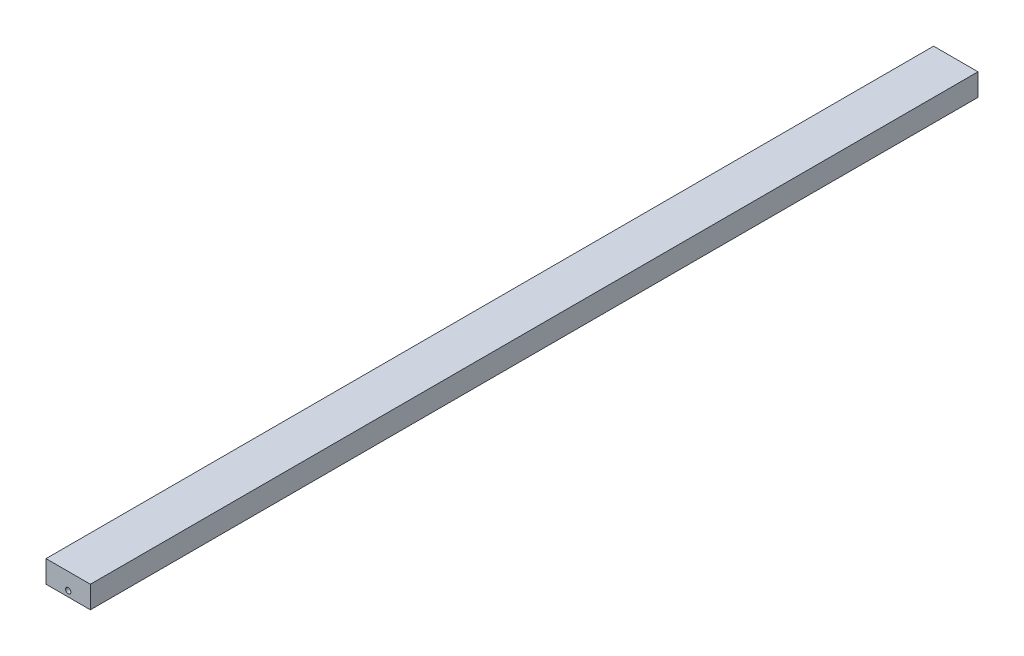
ISO-10303-21;
HEADER;
FILE_DESCRIPTION(('STEP AP214'),'2;1');
FILE_NAME('part.step','',(''),(''),'','','');
FILE_SCHEMA(('AUTOMOTIVE_DESIGN { 1 0 10303 214 1 1 1 1 }'));
ENDSEC;
DATA;
#1=APPLICATION_CONTEXT('core data for automotive mechanical design processes');
#2=APPLICATION_PROTOCOL_DEFINITION('international standard','automotive_design',2000,#1);
#3=PRODUCT_CONTEXT('',#1,'mechanical');
#4=PRODUCT('Part','Part','',(#3));
#5=PRODUCT_RELATED_PRODUCT_CATEGORY('part','',(#4));
#6=PRODUCT_DEFINITION_FORMATION('','',#4);
#7=PRODUCT_DEFINITION_CONTEXT('part definition',#1,'design');
#8=PRODUCT_DEFINITION('design','',#6,#7);
#9=PRODUCT_DEFINITION_SHAPE('','',#8);
#10=(LENGTH_UNIT() NAMED_UNIT(*) SI_UNIT(.MILLI.,.METRE.));
#11=(NAMED_UNIT(*) PLANE_ANGLE_UNIT() SI_UNIT($,.RADIAN.));
#12=(NAMED_UNIT(*) SI_UNIT($,.STERADIAN.) SOLID_ANGLE_UNIT());
#13=UNCERTAINTY_MEASURE_WITH_UNIT(LENGTH_MEASURE(1.E-05),#10,'distance_accuracy_value','');
#14=(GEOMETRIC_REPRESENTATION_CONTEXT(3) GLOBAL_UNCERTAINTY_ASSIGNED_CONTEXT((#13)) GLOBAL_UNIT_ASSIGNED_CONTEXT((#10,
#11,#12)) REPRESENTATION_CONTEXT('',''));
#15=CARTESIAN_POINT('',(0.,0.,0.));
#16=DIRECTION('',(0.,0.,1.));
#17=DIRECTION('',(1.,0.,0.));
#18=AXIS2_PLACEMENT_3D('',#15,#16,#17);
#19=CARTESIAN_POINT('',(0.,-1.25,200.));
#20=DIRECTION('',(0.,0.,-1.));
#21=DIRECTION('',(-1.,0.,0.));
#22=AXIS2_PLACEMENT_3D('',#19,#20,#21);
#23=CYLINDRICAL_SURFACE('',#22,0.6);
#24=CARTESIAN_POINT('',(0.,-1.25,200.));
#25=DIRECTION('',(0.,0.,1.));
#26=DIRECTION('',(1.,0.,0.));
#27=AXIS2_PLACEMENT_3D('',#24,#25,#26);
#28=CIRCLE('',#27,0.6);
#29=CARTESIAN_POINT('',(0.6,-1.25,200.));
#30=VERTEX_POINT('',#29);
#31=CARTESIAN_POINT('',(-0.6,-1.25,200.));
#32=VERTEX_POINT('',#31);
#33=EDGE_CURVE('E138',#30,#32,#28,.T.);
#34=ORIENTED_EDGE('',*,*,#33,.T.);
#35=DIRECTION('',(0.,0.,-1.));
#36=VECTOR('',#35,1.);
#37=CARTESIAN_POINT('',(-0.6,-1.25,200.));
#38=LINE('',#37,#36);
#39=CARTESIAN_POINT('',(-0.6,-1.25,0.));
#40=VERTEX_POINT('',#39);
#41=EDGE_CURVE('E12',#32,#40,#38,.T.);
#42=ORIENTED_EDGE('',*,*,#41,.T.);
#43=CARTESIAN_POINT('',(0.,-1.25,0.));
#44=DIRECTION('',(0.,0.,1.));
#45=DIRECTION('',(1.,0.,0.));
#46=AXIS2_PLACEMENT_3D('',#43,#44,#45);
#47=CIRCLE('',#46,0.6);
#48=CARTESIAN_POINT('',(0.6,-1.25,0.));
#49=VERTEX_POINT('',#48);
#50=EDGE_CURVE('E140',#49,#40,#47,.T.);
#51=ORIENTED_EDGE('',*,*,#50,.F.);
#52=DIRECTION('',(0.,0.,-1.));
#53=VECTOR('',#52,1.);
#54=CARTESIAN_POINT('',(0.6,-1.25,200.));
#55=LINE('',#54,#53);
#56=EDGE_CURVE('E56',#49,#30,#55,.F.);
#57=ORIENTED_EDGE('',*,*,#56,.T.);
#58=EDGE_LOOP('',(#34,#42,#51,#57));
#59=FACE_BOUND('',#58,.T.);
#60=ADVANCED_FACE('F47',(#59),#23,.F.);
#61=CARTESIAN_POINT('',(5.,2.5,200.));
#62=DIRECTION('',(-1.,0.,0.));
#63=DIRECTION('',(0.,0.,1.));
#64=AXIS2_PLACEMENT_3D('',#61,#62,#63);
#65=PLANE('',#64);
#66=DIRECTION('',(0.,1.,0.));
#67=VECTOR('',#66,1.);
#68=CARTESIAN_POINT('',(5.,2.5,0.));
#69=LINE('',#68,#67);
#70=CARTESIAN_POINT('',(5.,-2.5,0.));
#71=VERTEX_POINT('',#70);
#72=CARTESIAN_POINT('',(5.,2.5,0.));
#73=VERTEX_POINT('',#72);
#74=EDGE_CURVE('E122',#71,#73,#69,.T.);
#75=ORIENTED_EDGE('',*,*,#74,.T.);
#76=DIRECTION('',(0.,0.,-1.));
#77=VECTOR('',#76,1.);
#78=CARTESIAN_POINT('',(5.,2.5,200.));
#79=LINE('',#78,#77);
#80=CARTESIAN_POINT('',(5.,2.5,200.));
#81=VERTEX_POINT('',#80);
#82=EDGE_CURVE('E103',#81,#73,#79,.T.);
#83=ORIENTED_EDGE('',*,*,#82,.F.);
#84=DIRECTION('',(0.,1.,0.));
#85=VECTOR('',#84,1.);
#86=CARTESIAN_POINT('',(5.,2.5,200.));
#87=LINE('',#86,#85);
#88=CARTESIAN_POINT('',(5.,-2.5,200.));
#89=VERTEX_POINT('',#88);
#90=EDGE_CURVE('E110',#89,#81,#87,.T.);
#91=ORIENTED_EDGE('',*,*,#90,.F.);
#92=DIRECTION('',(0.,0.,-1.));
#93=VECTOR('',#92,1.);
#94=CARTESIAN_POINT('',(5.,-2.5,200.));
#95=LINE('',#94,#93);
#96=EDGE_CURVE('E130',#89,#71,#95,.T.);
#97=ORIENTED_EDGE('',*,*,#96,.T.);
#98=EDGE_LOOP('',(#75,#83,#91,#97));
#99=FACE_BOUND('',#98,.T.);
#100=ADVANCED_FACE('F49',(#99),#65,.F.);
#101=CARTESIAN_POINT('',(-5.,2.5,200.));
#102=DIRECTION('',(0.,-1.,0.));
#103=DIRECTION('',(0.,0.,-1.));
#104=AXIS2_PLACEMENT_3D('',#101,#102,#103);
#105=PLANE('',#104);
#106=DIRECTION('',(-1.,0.,0.));
#107=VECTOR('',#106,1.);
#108=CARTESIAN_POINT('',(-5.,2.5,0.));
#109=LINE('',#108,#107);
#110=CARTESIAN_POINT('',(-5.,2.5,0.));
#111=VERTEX_POINT('',#110);
#112=EDGE_CURVE('E135',#73,#111,#109,.T.);
#113=ORIENTED_EDGE('',*,*,#112,.T.);
#114=DIRECTION('',(0.,0.,-1.));
#115=VECTOR('',#114,1.);
#116=CARTESIAN_POINT('',(-5.,2.5,200.));
#117=LINE('',#116,#115);
#118=CARTESIAN_POINT('',(-5.,2.5,200.));
#119=VERTEX_POINT('',#118);
#120=EDGE_CURVE('E106',#119,#111,#117,.T.);
#121=ORIENTED_EDGE('',*,*,#120,.F.);
#122=DIRECTION('',(-1.,0.,0.));
#123=VECTOR('',#122,1.);
#124=CARTESIAN_POINT('',(-5.,2.5,200.));
#125=LINE('',#124,#123);
#126=EDGE_CURVE('E99',#81,#119,#125,.T.);
#127=ORIENTED_EDGE('',*,*,#126,.F.);
#128=ORIENTED_EDGE('',*,*,#82,.T.);
#129=EDGE_LOOP('',(#113,#121,#127,#128));
#130=FACE_BOUND('',#129,.T.);
#131=ADVANCED_FACE('F101',(#130),#105,.F.);
#132=CARTESIAN_POINT('',(-5.,2.5,200.));
#133=DIRECTION('',(1.,0.,0.));
#134=DIRECTION('',(0.,0.,-1.));
#135=AXIS2_PLACEMENT_3D('',#132,#133,#134);
#136=PLANE('',#135);
#137=DIRECTION('',(0.,-1.,0.));
#138=VECTOR('',#137,1.);
#139=CARTESIAN_POINT('',(-5.,2.5,0.));
#140=LINE('',#139,#138);
#141=CARTESIAN_POINT('',(-5.,-2.5,0.));
#142=VERTEX_POINT('',#141);
#143=EDGE_CURVE('E133',#111,#142,#140,.T.);
#144=ORIENTED_EDGE('',*,*,#143,.T.);
#145=DIRECTION('',(0.,0.,-1.));
#146=VECTOR('',#145,1.);
#147=CARTESIAN_POINT('',(-5.,-2.5,200.));
#148=LINE('',#147,#146);
#149=CARTESIAN_POINT('',(-5.,-2.5,200.));
#150=VERTEX_POINT('',#149);
#151=EDGE_CURVE('E125',#150,#142,#148,.T.);
#152=ORIENTED_EDGE('',*,*,#151,.F.);
#153=DIRECTION('',(0.,-1.,0.));
#154=VECTOR('',#153,1.);
#155=CARTESIAN_POINT('',(-5.,2.5,200.));
#156=LINE('',#155,#154);
#157=EDGE_CURVE('E109',#119,#150,#156,.T.);
#158=ORIENTED_EDGE('',*,*,#157,.F.);
#159=ORIENTED_EDGE('',*,*,#120,.T.);
#160=EDGE_LOOP('',(#144,#152,#158,#159));
#161=FACE_BOUND('',#160,.T.);
#162=ADVANCED_FACE('F166',(#161),#136,.F.);
#163=CARTESIAN_POINT('',(-5.,-2.5,200.));
#164=DIRECTION('',(0.,1.,0.));
#165=DIRECTION('',(0.,0.,1.));
#166=AXIS2_PLACEMENT_3D('',#163,#164,#165);
#167=PLANE('',#166);
#168=DIRECTION('',(1.,0.,0.));
#169=VECTOR('',#168,1.);
#170=CARTESIAN_POINT('',(-5.,-2.5,0.));
#171=LINE('',#170,#169);
#172=EDGE_CURVE('E119',#142,#71,#171,.T.);
#173=ORIENTED_EDGE('',*,*,#172,.T.);
#174=ORIENTED_EDGE('',*,*,#96,.F.);
#175=DIRECTION('',(1.,0.,0.));
#176=VECTOR('',#175,1.);
#177=CARTESIAN_POINT('',(-5.,-2.5,200.));
#178=LINE('',#177,#176);
#179=EDGE_CURVE('E115',#150,#89,#178,.T.);
#180=ORIENTED_EDGE('',*,*,#179,.F.);
#181=ORIENTED_EDGE('',*,*,#151,.T.);
#182=EDGE_LOOP('',(#173,#174,#180,#181));
#183=FACE_BOUND('',#182,.T.);
#184=ADVANCED_FACE('F158',(#183),#167,.F.);
#185=CARTESIAN_POINT('',(0.,0.,200.));
#186=DIRECTION('',(0.,0.,1.));
#187=DIRECTION('',(1.,0.,0.));
#188=AXIS2_PLACEMENT_3D('',#185,#186,#187);
#189=PLANE('',#188);
#190=ORIENTED_EDGE('',*,*,#33,.F.);
#191=EDGE_CURVE('E145',#32,#30,#28,.T.);
#192=ORIENTED_EDGE('',*,*,#191,.F.);
#193=EDGE_LOOP('',(#190,#192));
#194=FACE_BOUND('',#193,.T.);
#195=ORIENTED_EDGE('',*,*,#90,.T.);
#196=ORIENTED_EDGE('',*,*,#126,.T.);
#197=ORIENTED_EDGE('',*,*,#157,.T.);
#198=ORIENTED_EDGE('',*,*,#179,.T.);
#199=EDGE_LOOP('',(#195,#196,#197,#198));
#200=FACE_BOUND('',#199,.T.);
#201=ADVANCED_FACE('F113',(#194,#200),#189,.T.);
#202=CARTESIAN_POINT('',(0.,0.,0.));
#203=DIRECTION('',(0.,0.,1.));
#204=DIRECTION('',(1.,0.,0.));
#205=AXIS2_PLACEMENT_3D('',#202,#203,#204);
#206=PLANE('',#205);
#207=ORIENTED_EDGE('',*,*,#50,.T.);
#208=EDGE_CURVE('E146',#40,#49,#47,.T.);
#209=ORIENTED_EDGE('',*,*,#208,.T.);
#210=EDGE_LOOP('',(#207,#209));
#211=FACE_BOUND('',#210,.T.);
#212=ORIENTED_EDGE('',*,*,#74,.F.);
#213=ORIENTED_EDGE('',*,*,#172,.F.);
#214=ORIENTED_EDGE('',*,*,#143,.F.);
#215=ORIENTED_EDGE('',*,*,#112,.F.);
#216=EDGE_LOOP('',(#212,#213,#214,#215));
#217=FACE_BOUND('',#216,.T.);
#218=ADVANCED_FACE('F157',(#211,#217),#206,.F.);
#219=ORIENTED_EDGE('',*,*,#41,.F.);
#220=ORIENTED_EDGE('',*,*,#191,.T.);
#221=ORIENTED_EDGE('',*,*,#56,.F.);
#222=ORIENTED_EDGE('',*,*,#208,.F.);
#223=EDGE_LOOP('',(#219,#220,#221,#222));
#224=FACE_BOUND('',#223,.T.);
#225=ADVANCED_FACE('F154',(#224),#23,.F.);
#226=CLOSED_SHELL('',(#60,#100,#131,#162,#184,#201,#218,#225));
#227=MANIFOLD_SOLID_BREP('B2',#226);
#228=ADVANCED_BREP_SHAPE_REPRESENTATION('',(#18,#227),#14);
#229=SHAPE_DEFINITION_REPRESENTATION(#9,#228);
ENDSEC;
END-ISO-10303-21;
